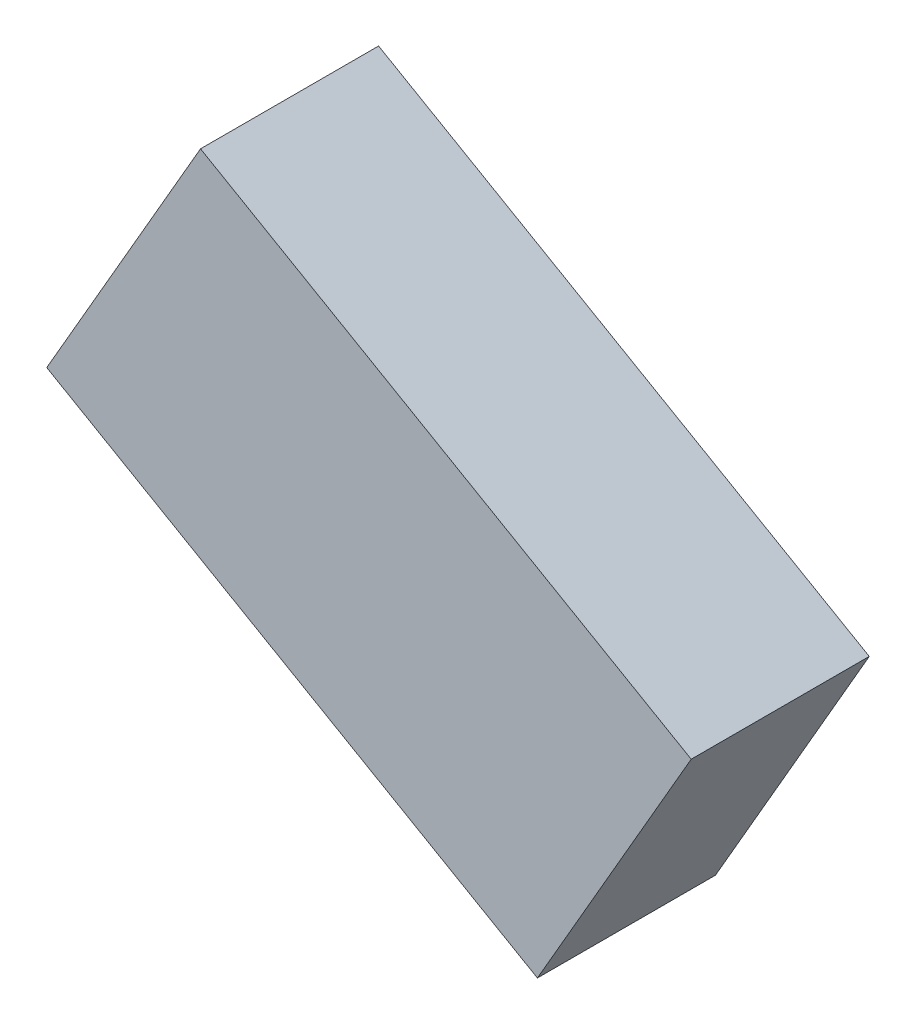
ISO-10303-21;
HEADER;
FILE_DESCRIPTION(('STEP AP214'),'2;1');
FILE_NAME('part.step','',(''),(''),'','','');
FILE_SCHEMA(('AUTOMOTIVE_DESIGN { 1 0 10303 214 1 1 1 1 }'));
ENDSEC;
DATA;
#1=APPLICATION_CONTEXT('core data for automotive mechanical design processes');
#2=APPLICATION_PROTOCOL_DEFINITION('international standard','automotive_design',2000,#1);
#3=PRODUCT_CONTEXT('',#1,'mechanical');
#4=PRODUCT('Part','Part','',(#3));
#5=PRODUCT_RELATED_PRODUCT_CATEGORY('part','',(#4));
#6=PRODUCT_DEFINITION_FORMATION('','',#4);
#7=PRODUCT_DEFINITION_CONTEXT('part definition',#1,'design');
#8=PRODUCT_DEFINITION('design','',#6,#7);
#9=PRODUCT_DEFINITION_SHAPE('','',#8);
#10=(LENGTH_UNIT() NAMED_UNIT(*) SI_UNIT(.MILLI.,.METRE.));
#11=(NAMED_UNIT(*) PLANE_ANGLE_UNIT() SI_UNIT($,.RADIAN.));
#12=(NAMED_UNIT(*) SI_UNIT($,.STERADIAN.) SOLID_ANGLE_UNIT());
#13=UNCERTAINTY_MEASURE_WITH_UNIT(LENGTH_MEASURE(1.E-05),#10,'distance_accuracy_value','');
#14=(GEOMETRIC_REPRESENTATION_CONTEXT(3) GLOBAL_UNCERTAINTY_ASSIGNED_CONTEXT((#13)) GLOBAL_UNIT_ASSIGNED_CONTEXT((#10,
#11,#12)) REPRESENTATION_CONTEXT('',''));
#15=CARTESIAN_POINT('',(0.,0.,0.));
#16=DIRECTION('',(0.,0.,1.));
#17=DIRECTION('',(1.,0.,0.));
#18=AXIS2_PLACEMENT_3D('',#15,#16,#17);
#19=CARTESIAN_POINT('',(-0.99527106,0.0261366,0.5499989));
#20=DIRECTION('',(0.,0.,-1.));
#21=DIRECTION('',(-1.,0.,0.));
#22=AXIS2_PLACEMENT_3D('',#19,#20,#21);
#23=PLANE('',#22);
#24=DIRECTION('',(-0.499998098330148,-0.866026501711256,0.));
#25=VECTOR('',#24,1.);
#26=CARTESIAN_POINT('',(0.52027328,-0.84886292,0.5499989));
#27=LINE('',#26,#25);
#28=CARTESIAN_POINT('',(0.520273280000034,-0.848862919999941,0.5499989));
#29=VERTEX_POINT('',#28);
#30=CARTESIAN_POINT('',(0.995273600000001,-0.0261340600000004,0.5499989));
#31=VERTEX_POINT('',#30);
#32=EDGE_CURVE('E55',#29,#31,#27,.F.);
#33=ORIENTED_EDGE('',*,*,#32,.T.);
#34=DIRECTION('',(0.866026134380101,-0.499998734569058,0.));
#35=VECTOR('',#34,1.);
#36=CARTESIAN_POINT('',(0.9952736,-0.02613406,0.5499989));
#37=LINE('',#36,#35);
#38=CARTESIAN_POINT('',(-0.520270740000045,0.848862919999921,0.5499989));
#39=VERTEX_POINT('',#38);
#40=EDGE_CURVE('E57',#31,#39,#37,.F.);
#41=ORIENTED_EDGE('',*,*,#40,.T.);
#42=DIRECTION('',(0.499999256063104,0.86602583329618,0.));
#43=VECTOR('',#42,1.);
#44=CARTESIAN_POINT('',(-0.52027074,0.84886292,0.5499989));
#45=LINE('',#44,#43);
#46=CARTESIAN_POINT('',(-0.995271059999819,0.0261365999998956,0.5499989));
#47=VERTEX_POINT('',#46);
#48=EDGE_CURVE('E20',#39,#47,#45,.F.);
#49=ORIENTED_EDGE('',*,*,#48,.T.);
#50=DIRECTION('',(-0.866025505893321,0.499999823142186,0.));
#51=VECTOR('',#50,1.);
#52=CARTESIAN_POINT('',(-0.99527106,0.0261366,0.5499989));
#53=LINE('',#52,#51);
#54=EDGE_CURVE('E80',#47,#29,#53,.F.);
#55=ORIENTED_EDGE('',*,*,#54,.T.);
#56=EDGE_LOOP('',(#33,#41,#49,#55));
#57=FACE_BOUND('',#56,.T.);
#58=ADVANCED_FACE('F17',(#57),#23,.F.);
#59=CARTESIAN_POINT('',(-0.52027074,0.84886292,0.));
#60=DIRECTION('',(0.86602583329618,-0.499999256063104,0.));
#61=DIRECTION('',(0.499999256063104,0.86602583329618,0.));
#62=AXIS2_PLACEMENT_3D('',#59,#60,#61);
#63=PLANE('',#62);
#64=DIRECTION('',(0.,0.,1.));
#65=VECTOR('',#64,1.);
#66=CARTESIAN_POINT('',(-0.99527106,0.0261366,0.));
#67=LINE('',#66,#65);
#68=CARTESIAN_POINT('',(-0.995271059999819,0.0261365999998956,0.));
#69=VERTEX_POINT('',#68);
#70=EDGE_CURVE('E68',#69,#47,#67,.T.);
#71=ORIENTED_EDGE('',*,*,#70,.T.);
#72=ORIENTED_EDGE('',*,*,#48,.F.);
#73=DIRECTION('',(0.,0.,1.));
#74=VECTOR('',#73,1.);
#75=CARTESIAN_POINT('',(-0.520270740000182,0.848862919999685,0.));
#76=LINE('',#75,#74);
#77=CARTESIAN_POINT('',(-0.520270740000045,0.848862919999921,0.));
#78=VERTEX_POINT('',#77);
#79=EDGE_CURVE('E63',#39,#78,#76,.F.);
#80=ORIENTED_EDGE('',*,*,#79,.T.);
#81=DIRECTION('',(0.499999256063484,0.86602583329596,0.));
#82=VECTOR('',#81,1.);
#83=CARTESIAN_POINT('',(-0.99527106,0.0261366,0.));
#84=LINE('',#83,#82);
#85=EDGE_CURVE('E83',#69,#78,#84,.T.);
#86=ORIENTED_EDGE('',*,*,#85,.F.);
#87=EDGE_LOOP('',(#71,#72,#80,#86));
#88=FACE_BOUND('',#87,.T.);
#89=ADVANCED_FACE('F65',(#88),#63,.F.);
#90=CARTESIAN_POINT('',(0.9952736,-0.02613406,0.));
#91=DIRECTION('',(-0.499998734569058,-0.866026134380101,0.));
#92=DIRECTION('',(0.866026134380101,-0.499998734569058,0.));
#93=AXIS2_PLACEMENT_3D('',#90,#91,#92);
#94=PLANE('',#93);
#95=ORIENTED_EDGE('',*,*,#79,.F.);
#96=ORIENTED_EDGE('',*,*,#40,.F.);
#97=DIRECTION('',(0.,0.,1.));
#98=VECTOR('',#97,1.);
#99=CARTESIAN_POINT('',(0.995273600000003,-0.0261340600000015,0.));
#100=LINE('',#99,#98);
#101=CARTESIAN_POINT('',(0.995273600000001,-0.0261340600000004,0.));
#102=VERTEX_POINT('',#101);
#103=EDGE_CURVE('E75',#31,#102,#100,.F.);
#104=ORIENTED_EDGE('',*,*,#103,.T.);
#105=DIRECTION('',(0.866026134379997,-0.499998734569238,0.));
#106=VECTOR('',#105,1.);
#107=CARTESIAN_POINT('',(-0.52027074,0.84886292,0.));
#108=LINE('',#107,#106);
#109=EDGE_CURVE('E72',#78,#102,#108,.T.);
#110=ORIENTED_EDGE('',*,*,#109,.F.);
#111=EDGE_LOOP('',(#95,#96,#104,#110));
#112=FACE_BOUND('',#111,.T.);
#113=ADVANCED_FACE('F70',(#112),#94,.F.);
#114=CARTESIAN_POINT('',(0.52027328,-0.84886292,0.));
#115=DIRECTION('',(-0.866026501711256,0.499998098330148,0.));
#116=DIRECTION('',(-0.499998098330148,-0.866026501711256,0.));
#117=AXIS2_PLACEMENT_3D('',#114,#115,#116);
#118=PLANE('',#117);
#119=ORIENTED_EDGE('',*,*,#103,.F.);
#120=ORIENTED_EDGE('',*,*,#32,.F.);
#121=DIRECTION('',(0.,0.,1.));
#122=VECTOR('',#121,1.);
#123=CARTESIAN_POINT('',(0.520273280000137,-0.848862919999764,0.));
#124=LINE('',#123,#122);
#125=CARTESIAN_POINT('',(0.520273280000034,-0.848862919999941,0.));
#126=VERTEX_POINT('',#125);
#127=EDGE_CURVE('E35',#29,#126,#124,.F.);
#128=ORIENTED_EDGE('',*,*,#127,.T.);
#129=DIRECTION('',(-0.499998098330145,-0.866026501711258,0.));
#130=VECTOR('',#129,1.);
#131=CARTESIAN_POINT('',(0.9952736,-0.02613406,0.));
#132=LINE('',#131,#130);
#133=EDGE_CURVE('E26',#102,#126,#132,.T.);
#134=ORIENTED_EDGE('',*,*,#133,.F.);
#135=EDGE_LOOP('',(#119,#120,#128,#134));
#136=FACE_BOUND('',#135,.T.);
#137=ADVANCED_FACE('F89',(#136),#118,.F.);
#138=CARTESIAN_POINT('',(-0.99527106,0.0261366,0.));
#139=DIRECTION('',(0.499999823142186,0.866025505893321,0.));
#140=DIRECTION('',(-0.866025505893321,0.499999823142186,0.));
#141=AXIS2_PLACEMENT_3D('',#138,#139,#140);
#142=PLANE('',#141);
#143=ORIENTED_EDGE('',*,*,#127,.F.);
#144=ORIENTED_EDGE('',*,*,#54,.F.);
#145=ORIENTED_EDGE('',*,*,#70,.F.);
#146=DIRECTION('',(-0.866025505893243,0.499999823142321,0.));
#147=VECTOR('',#146,1.);
#148=CARTESIAN_POINT('',(0.52027328,-0.84886292,0.));
#149=LINE('',#148,#147);
#150=EDGE_CURVE('E11',#126,#69,#149,.T.);
#151=ORIENTED_EDGE('',*,*,#150,.F.);
#152=EDGE_LOOP('',(#143,#144,#145,#151));
#153=FACE_BOUND('',#152,.T.);
#154=ADVANCED_FACE('F91',(#153),#142,.F.);
#155=CARTESIAN_POINT('',(-0.99527106,0.0261366,0.));
#156=DIRECTION('',(0.,0.,-1.));
#157=DIRECTION('',(-1.,0.,0.));
#158=AXIS2_PLACEMENT_3D('',#155,#156,#157);
#159=PLANE('',#158);
#160=ORIENTED_EDGE('',*,*,#133,.T.);
#161=ORIENTED_EDGE('',*,*,#150,.T.);
#162=ORIENTED_EDGE('',*,*,#85,.T.);
#163=ORIENTED_EDGE('',*,*,#109,.T.);
#164=EDGE_LOOP('',(#160,#161,#162,#163));
#165=FACE_BOUND('',#164,.T.);
#166=ADVANCED_FACE('F88',(#165),#159,.T.);
#167=CLOSED_SHELL('',(#58,#89,#113,#137,#154,#166));
#168=MANIFOLD_SOLID_BREP('B1',#167);
#169=ADVANCED_BREP_SHAPE_REPRESENTATION('',(#18,#168),#14);
#170=SHAPE_DEFINITION_REPRESENTATION(#9,#169);
ENDSEC;
END-ISO-10303-21;
